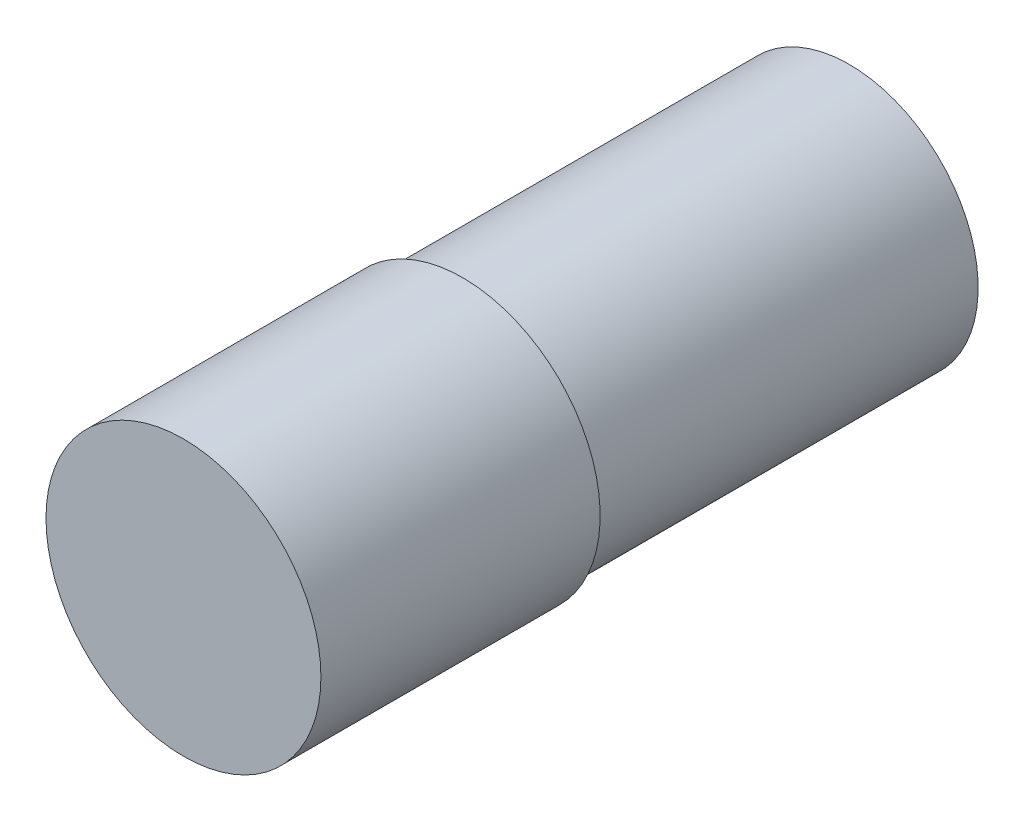
ISO-10303-21;
HEADER;
FILE_DESCRIPTION(('STEP AP214'),'2;1');
FILE_NAME('part.step','',(''),(''),'','','');
FILE_SCHEMA(('AUTOMOTIVE_DESIGN { 1 0 10303 214 1 1 1 1 }'));
ENDSEC;
DATA;
#1=APPLICATION_CONTEXT('core data for automotive mechanical design processes');
#2=APPLICATION_PROTOCOL_DEFINITION('international standard','automotive_design',2000,#1);
#3=PRODUCT_CONTEXT('',#1,'mechanical');
#4=PRODUCT('Part','Part','',(#3));
#5=PRODUCT_RELATED_PRODUCT_CATEGORY('part','',(#4));
#6=PRODUCT_DEFINITION_FORMATION('','',#4);
#7=PRODUCT_DEFINITION_CONTEXT('part definition',#1,'design');
#8=PRODUCT_DEFINITION('design','',#6,#7);
#9=PRODUCT_DEFINITION_SHAPE('','',#8);
#10=(LENGTH_UNIT() NAMED_UNIT(*) SI_UNIT(.MILLI.,.METRE.));
#11=(NAMED_UNIT(*) PLANE_ANGLE_UNIT() SI_UNIT($,.RADIAN.));
#12=(NAMED_UNIT(*) SI_UNIT($,.STERADIAN.) SOLID_ANGLE_UNIT());
#13=UNCERTAINTY_MEASURE_WITH_UNIT(LENGTH_MEASURE(1.E-05),#10,'distance_accuracy_value','');
#14=(GEOMETRIC_REPRESENTATION_CONTEXT(3) GLOBAL_UNCERTAINTY_ASSIGNED_CONTEXT((#13)) GLOBAL_UNIT_ASSIGNED_CONTEXT((#10,
#11,#12)) REPRESENTATION_CONTEXT('',''));
#15=CARTESIAN_POINT('',(0.,0.,0.));
#16=DIRECTION('',(0.,0.,1.));
#17=DIRECTION('',(1.,0.,0.));
#18=AXIS2_PLACEMENT_3D('',#15,#16,#17);
#19=CARTESIAN_POINT('',(0.,0.,15.5));
#20=DIRECTION('',(0.,0.,-1.));
#21=DIRECTION('',(-1.,0.,0.));
#22=AXIS2_PLACEMENT_3D('',#19,#20,#21);
#23=CYLINDRICAL_SURFACE('',#22,3.2);
#24=CARTESIAN_POINT('',(0.,0.,15.5));
#25=DIRECTION('',(0.,0.,1.));
#26=DIRECTION('',(1.,0.,0.));
#27=AXIS2_PLACEMENT_3D('',#24,#25,#26);
#28=CIRCLE('',#27,3.2);
#29=CARTESIAN_POINT('',(3.2,0.,15.5));
#30=VERTEX_POINT('',#29);
#31=EDGE_CURVE('E10',#30,#30,#28,.T.);
#32=ORIENTED_EDGE('',*,*,#31,.F.);
#33=EDGE_LOOP('',(#32));
#34=FACE_BOUND('',#33,.T.);
#35=CARTESIAN_POINT('',(0.,0.,9.));
#36=DIRECTION('',(0.,0.,-1.));
#37=DIRECTION('',(-1.,0.,0.));
#38=AXIS2_PLACEMENT_3D('',#35,#36,#37);
#39=CIRCLE('',#38,3.2);
#40=CARTESIAN_POINT('',(-3.2,0.,9.));
#41=VERTEX_POINT('',#40);
#42=EDGE_CURVE('E37',#41,#41,#39,.T.);
#43=ORIENTED_EDGE('',*,*,#42,.F.);
#44=EDGE_LOOP('',(#43));
#45=FACE_BOUND('',#44,.T.);
#46=ADVANCED_FACE('F31',(#34,#45),#23,.T.);
#47=CARTESIAN_POINT('',(0.,0.,15.5));
#48=DIRECTION('',(0.,0.,1.));
#49=DIRECTION('',(1.,0.,0.));
#50=AXIS2_PLACEMENT_3D('',#47,#48,#49);
#51=PLANE('',#50);
#52=ORIENTED_EDGE('',*,*,#31,.T.);
#53=EDGE_LOOP('',(#52));
#54=FACE_BOUND('',#53,.T.);
#55=ADVANCED_FACE('F62',(#54),#51,.T.);
#56=CARTESIAN_POINT('',(0.,0.,9.));
#57=DIRECTION('',(0.,0.,-1.));
#58=DIRECTION('',(-1.,0.,0.));
#59=AXIS2_PLACEMENT_3D('',#56,#57,#58);
#60=PLANE('',#59);
#61=CARTESIAN_POINT('',(0.,0.,9.));
#62=DIRECTION('',(0.,0.,-1.));
#63=DIRECTION('',(-1.,0.,0.));
#64=AXIS2_PLACEMENT_3D('',#61,#62,#63);
#65=CIRCLE('',#64,3.);
#66=CARTESIAN_POINT('',(-3.,0.,9.));
#67=VERTEX_POINT('',#66);
#68=EDGE_CURVE('E41',#67,#67,#65,.T.);
#69=ORIENTED_EDGE('',*,*,#68,.F.);
#70=EDGE_LOOP('',(#69));
#71=FACE_BOUND('',#70,.T.);
#72=ORIENTED_EDGE('',*,*,#42,.T.);
#73=EDGE_LOOP('',(#72));
#74=FACE_BOUND('',#73,.T.);
#75=ADVANCED_FACE('F55',(#71,#74),#60,.T.);
#76=CARTESIAN_POINT('',(0.,0.,9.));
#77=DIRECTION('',(0.,0.,-1.));
#78=DIRECTION('',(-1.,0.,0.));
#79=AXIS2_PLACEMENT_3D('',#76,#77,#78);
#80=CYLINDRICAL_SURFACE('',#79,3.);
#81=ORIENTED_EDGE('',*,*,#68,.T.);
#82=EDGE_LOOP('',(#81));
#83=FACE_BOUND('',#82,.T.);
#84=CARTESIAN_POINT('',(0.,0.,0.));
#85=DIRECTION('',(0.,0.,-1.));
#86=DIRECTION('',(-1.,0.,0.));
#87=AXIS2_PLACEMENT_3D('',#84,#85,#86);
#88=CIRCLE('',#87,3.);
#89=CARTESIAN_POINT('',(-3.,0.,0.));
#90=VERTEX_POINT('',#89);
#91=EDGE_CURVE('E45',#90,#90,#88,.T.);
#92=ORIENTED_EDGE('',*,*,#91,.F.);
#93=EDGE_LOOP('',(#92));
#94=FACE_BOUND('',#93,.T.);
#95=ADVANCED_FACE('F53',(#83,#94),#80,.T.);
#96=CARTESIAN_POINT('',(0.,0.,0.));
#97=DIRECTION('',(0.,0.,1.));
#98=DIRECTION('',(1.,0.,0.));
#99=AXIS2_PLACEMENT_3D('',#96,#97,#98);
#100=PLANE('',#99);
#101=ORIENTED_EDGE('',*,*,#91,.T.);
#102=EDGE_LOOP('',(#101));
#103=FACE_BOUND('',#102,.T.);
#104=ADVANCED_FACE('F51',(#103),#100,.F.);
#105=CLOSED_SHELL('',(#46,#55,#75,#95,#104));
#106=MANIFOLD_SOLID_BREP('B2',#105);
#107=ADVANCED_BREP_SHAPE_REPRESENTATION('',(#18,#106),#14);
#108=SHAPE_DEFINITION_REPRESENTATION(#9,#107);
ENDSEC;
END-ISO-10303-21;
